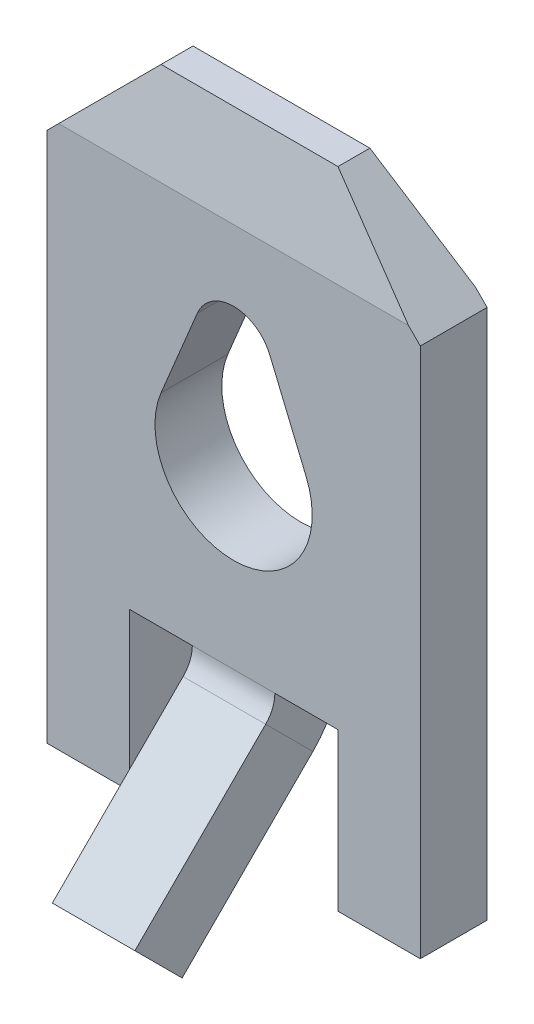
ISO-10303-21;
HEADER;
FILE_DESCRIPTION(('STEP AP214'),'2;1');
FILE_NAME('part.step','',(''),(''),'','','');
FILE_SCHEMA(('AUTOMOTIVE_DESIGN { 1 0 10303 214 1 1 1 1 }'));
ENDSEC;
DATA;
#1=APPLICATION_CONTEXT('core data for automotive mechanical design processes');
#2=APPLICATION_PROTOCOL_DEFINITION('international standard','automotive_design',2000,#1);
#3=PRODUCT_CONTEXT('',#1,'mechanical');
#4=PRODUCT('Part','Part','',(#3));
#5=PRODUCT_RELATED_PRODUCT_CATEGORY('part','',(#4));
#6=PRODUCT_DEFINITION_FORMATION('','',#4);
#7=PRODUCT_DEFINITION_CONTEXT('part definition',#1,'design');
#8=PRODUCT_DEFINITION('design','',#6,#7);
#9=PRODUCT_DEFINITION_SHAPE('','',#8);
#10=(LENGTH_UNIT() NAMED_UNIT(*) SI_UNIT(.MILLI.,.METRE.));
#11=(NAMED_UNIT(*) PLANE_ANGLE_UNIT() SI_UNIT($,.RADIAN.));
#12=(NAMED_UNIT(*) SI_UNIT($,.STERADIAN.) SOLID_ANGLE_UNIT());
#13=UNCERTAINTY_MEASURE_WITH_UNIT(LENGTH_MEASURE(1.E-05),#10,'distance_accuracy_value','');
#14=(GEOMETRIC_REPRESENTATION_CONTEXT(3) GLOBAL_UNCERTAINTY_ASSIGNED_CONTEXT((#13)) GLOBAL_UNIT_ASSIGNED_CONTEXT((#10,
#11,#12)) REPRESENTATION_CONTEXT('',''));
#15=CARTESIAN_POINT('',(0.,0.,0.));
#16=DIRECTION('',(0.,0.,1.));
#17=DIRECTION('',(1.,0.,0.));
#18=AXIS2_PLACEMENT_3D('',#15,#16,#17);
#19=CARTESIAN_POINT('',(4.75,0.149999999999999,0.));
#20=DIRECTION('',(0.,0.,1.));
#21=DIRECTION('',(0.,-1.,0.));
#22=AXIS2_PLACEMENT_3D('',#19,#20,#21);
#23=PLANE('',#22);
#24=DIRECTION('',(0.384813689288076,-0.922994271128754,0.));
#25=VECTOR('',#24,1.);
#26=CARTESIAN_POINT('',(2.84243697464802,5.82748992853653,0.));
#27=LINE('',#26,#25);
#28=CARTESIAN_POINT('',(2.84243697464802,5.82748992853653,0.));
#29=VERTEX_POINT('',#28);
#30=CARTESIAN_POINT('',(3.29799427112875,4.73481368928808,0.));
#31=VERTEX_POINT('',#30);
#32=EDGE_CURVE('E273',#29,#31,#27,.T.);
#33=ORIENTED_EDGE('',*,*,#32,.F.);
#34=CARTESIAN_POINT('',(2.375,5.65,0.));
#35=DIRECTION('',(0.,0.,1.));
#36=DIRECTION('',(0.,-1.,0.));
#37=AXIS2_PLACEMENT_3D('',#34,#35,#36);
#38=CIRCLE('',#37,0.5);
#39=CARTESIAN_POINT('',(1.91346153846154,5.84230769230769,0.));
#40=VERTEX_POINT('',#39);
#41=EDGE_CURVE('E276',#40,#29,#38,.F.);
#42=ORIENTED_EDGE('',*,*,#41,.F.);
#43=DIRECTION('',(0.384615384615385,0.923076923076923,0.));
#44=VECTOR('',#43,1.);
#45=CARTESIAN_POINT('',(1.91346153846154,5.84230769230769,0.));
#46=LINE('',#45,#44);
#47=CARTESIAN_POINT('',(1.45192307692308,4.73461538461538,0.));
#48=VERTEX_POINT('',#47);
#49=EDGE_CURVE('E278',#48,#40,#46,.T.);
#50=ORIENTED_EDGE('',*,*,#49,.F.);
#51=CARTESIAN_POINT('',(2.375,4.35,0.));
#52=DIRECTION('',(0.,0.,1.));
#53=DIRECTION('',(0.,-1.,0.));
#54=AXIS2_PLACEMENT_3D('',#51,#52,#53);
#55=CIRCLE('',#54,1.);
#56=EDGE_CURVE('E270',#31,#48,#55,.F.);
#57=ORIENTED_EDGE('',*,*,#56,.F.);
#58=EDGE_LOOP('',(#33,#42,#50,#57));
#59=FACE_BOUND('',#58,.T.);
#60=DIRECTION('',(1.,0.,0.));
#61=VECTOR('',#60,1.);
#62=CARTESIAN_POINT('',(2.9,2.15,0.));
#63=LINE('',#62,#61);
#64=CARTESIAN_POINT('',(2.9,2.15,0.));
#65=VERTEX_POINT('',#64);
#66=CARTESIAN_POINT('',(3.7,2.15,0.));
#67=VERTEX_POINT('',#66);
#68=EDGE_CURVE('E238',#65,#67,#63,.T.);
#69=ORIENTED_EDGE('',*,*,#68,.F.);
#70=DIRECTION('',(-1.,0.,0.));
#71=VECTOR('',#70,1.);
#72=CARTESIAN_POINT('',(4.75,2.15,0.));
#73=LINE('',#72,#71);
#74=CARTESIAN_POINT('',(1.85000000000001,2.15,0.));
#75=VERTEX_POINT('',#74);
#76=EDGE_CURVE('E51',#65,#75,#73,.T.);
#77=ORIENTED_EDGE('',*,*,#76,.T.);
#78=DIRECTION('',(1.,0.,0.));
#79=VECTOR('',#78,1.);
#80=CARTESIAN_POINT('',(1.85,2.15,0.));
#81=LINE('',#80,#79);
#82=CARTESIAN_POINT('',(1.05,2.15,0.));
#83=VERTEX_POINT('',#82);
#84=EDGE_CURVE('E249',#83,#75,#81,.T.);
#85=ORIENTED_EDGE('',*,*,#84,.F.);
#86=DIRECTION('',(0.,1.,0.));
#87=VECTOR('',#86,1.);
#88=CARTESIAN_POINT('',(1.05,2.15,0.));
#89=LINE('',#88,#87);
#90=CARTESIAN_POINT('',(1.05,0.149999999999999,0.));
#91=VERTEX_POINT('',#90);
#92=EDGE_CURVE('E247',#91,#83,#89,.T.);
#93=ORIENTED_EDGE('',*,*,#92,.F.);
#94=DIRECTION('',(-1.,0.,0.));
#95=VECTOR('',#94,1.);
#96=CARTESIAN_POINT('',(4.75,0.149999999999999,0.));
#97=LINE('',#96,#95);
#98=CARTESIAN_POINT('',(0.,0.149999999999999,0.));
#99=VERTEX_POINT('',#98);
#100=EDGE_CURVE('E347',#91,#99,#97,.T.);
#101=ORIENTED_EDGE('',*,*,#100,.T.);
#102=DIRECTION('',(0.,1.,0.));
#103=VECTOR('',#102,1.);
#104=CARTESIAN_POINT('',(0.,0.149999999999999,0.));
#105=LINE('',#104,#103);
#106=CARTESIAN_POINT('',(0.,6.9,0.));
#107=VERTEX_POINT('',#106);
#108=EDGE_CURVE('E332',#99,#107,#105,.T.);
#109=ORIENTED_EDGE('',*,*,#108,.T.);
#110=DIRECTION('',(-0.707106781186548,-0.707106781186548,0.));
#111=VECTOR('',#110,1.);
#112=CARTESIAN_POINT('',(0.,6.9,0.));
#113=LINE('',#112,#111);
#114=CARTESIAN_POINT('',(0.15,7.05,0.));
#115=VERTEX_POINT('',#114);
#116=EDGE_CURVE('E306',#115,#107,#113,.T.);
#117=ORIENTED_EDGE('',*,*,#116,.F.);
#118=DIRECTION('',(-1.,0.,0.));
#119=VECTOR('',#118,1.);
#120=CARTESIAN_POINT('',(4.75,7.05,0.));
#121=LINE('',#120,#119);
#122=CARTESIAN_POINT('',(4.6,7.05,0.));
#123=VERTEX_POINT('',#122);
#124=EDGE_CURVE('E337',#123,#115,#121,.T.);
#125=ORIENTED_EDGE('',*,*,#124,.F.);
#126=DIRECTION('',(-0.707106781186548,0.707106781186548,0.));
#127=VECTOR('',#126,1.);
#128=CARTESIAN_POINT('',(3.5,8.15,0.));
#129=LINE('',#128,#127);
#130=CARTESIAN_POINT('',(4.75,6.9,0.));
#131=VERTEX_POINT('',#130);
#132=EDGE_CURVE('E302',#131,#123,#129,.T.);
#133=ORIENTED_EDGE('',*,*,#132,.F.);
#134=DIRECTION('',(0.,1.,0.));
#135=VECTOR('',#134,1.);
#136=CARTESIAN_POINT('',(4.75,0.149999999999999,0.));
#137=LINE('',#136,#135);
#138=CARTESIAN_POINT('',(4.75,0.149999999999999,0.));
#139=VERTEX_POINT('',#138);
#140=EDGE_CURVE('E334',#139,#131,#137,.T.);
#141=ORIENTED_EDGE('',*,*,#140,.F.);
#142=CARTESIAN_POINT('',(3.7,0.149999999999999,0.));
#143=VERTEX_POINT('',#142);
#144=EDGE_CURVE('E348',#139,#143,#97,.T.);
#145=ORIENTED_EDGE('',*,*,#144,.T.);
#146=DIRECTION('',(0.,-1.,0.));
#147=VECTOR('',#146,1.);
#148=CARTESIAN_POINT('',(3.7,2.15,0.));
#149=LINE('',#148,#147);
#150=EDGE_CURVE('E262',#67,#143,#149,.T.);
#151=ORIENTED_EDGE('',*,*,#150,.F.);
#152=EDGE_LOOP('',(#69,#77,#85,#93,#101,#109,#117,#125,#133,#141,#145,#151));
#153=FACE_BOUND('',#152,.T.);
#154=ADVANCED_FACE('F44',(#59,#153),#23,.F.);
#155=CARTESIAN_POINT('',(4.75,7.05,0.85));
#156=DIRECTION('',(0.,0.,-1.));
#157=DIRECTION('',(0.,1.,0.));
#158=AXIS2_PLACEMENT_3D('',#155,#156,#157);
#159=PLANE('',#158);
#160=DIRECTION('',(-0.384615384615385,-0.923076923076923,0.));
#161=VECTOR('',#160,1.);
#162=CARTESIAN_POINT('',(1.91346153846154,5.84230769230769,0.849999999999999));
#163=LINE('',#162,#161);
#164=CARTESIAN_POINT('',(1.91346153846154,5.84230769230769,0.85));
#165=VERTEX_POINT('',#164);
#166=CARTESIAN_POINT('',(1.45192307692308,4.73461538461538,0.849999999999999));
#167=VERTEX_POINT('',#166);
#168=EDGE_CURVE('E280',#165,#167,#163,.T.);
#169=ORIENTED_EDGE('',*,*,#168,.F.);
#170=CARTESIAN_POINT('',(2.375,5.65,0.849999999999999));
#171=DIRECTION('',(0.,0.,1.));
#172=DIRECTION('',(1.,0.,0.));
#173=AXIS2_PLACEMENT_3D('',#170,#171,#172);
#174=CIRCLE('',#173,0.5);
#175=CARTESIAN_POINT('',(2.84243697464802,5.82748992853653,0.849999999999999));
#176=VERTEX_POINT('',#175);
#177=EDGE_CURVE('E256',#176,#165,#174,.T.);
#178=ORIENTED_EDGE('',*,*,#177,.F.);
#179=DIRECTION('',(-0.384813689288076,0.922994271128754,0.));
#180=VECTOR('',#179,1.);
#181=CARTESIAN_POINT('',(2.84243697464802,5.82748992853653,0.849999999999999));
#182=LINE('',#181,#180);
#183=CARTESIAN_POINT('',(3.29799427112875,4.73481368928808,0.849999999999999));
#184=VERTEX_POINT('',#183);
#185=EDGE_CURVE('E286',#184,#176,#182,.T.);
#186=ORIENTED_EDGE('',*,*,#185,.F.);
#187=CARTESIAN_POINT('',(2.375,4.35,0.849999999999999));
#188=DIRECTION('',(0.,0.,1.));
#189=DIRECTION('',(1.,0.,0.));
#190=AXIS2_PLACEMENT_3D('',#187,#188,#189);
#191=CIRCLE('',#190,1.);
#192=EDGE_CURVE('E283',#167,#184,#191,.T.);
#193=ORIENTED_EDGE('',*,*,#192,.F.);
#194=EDGE_LOOP('',(#169,#178,#186,#193));
#195=FACE_BOUND('',#194,.T.);
#196=DIRECTION('',(-1.,0.,0.));
#197=VECTOR('',#196,1.);
#198=CARTESIAN_POINT('',(1.85,2.15,0.85));
#199=LINE('',#198,#197);
#200=CARTESIAN_POINT('',(1.85000000000001,2.15,0.849999999999999));
#201=VERTEX_POINT('',#200);
#202=CARTESIAN_POINT('',(1.05,2.15,0.85));
#203=VERTEX_POINT('',#202);
#204=EDGE_CURVE('E243',#201,#203,#199,.T.);
#205=ORIENTED_EDGE('',*,*,#204,.F.);
#206=DIRECTION('',(1.,0.,0.));
#207=VECTOR('',#206,1.);
#208=CARTESIAN_POINT('',(4.75,2.15,0.849999999999999));
#209=LINE('',#208,#207);
#210=CARTESIAN_POINT('',(2.9,2.15,0.849999999999999));
#211=VERTEX_POINT('',#210);
#212=EDGE_CURVE('E364',#201,#211,#209,.T.);
#213=ORIENTED_EDGE('',*,*,#212,.T.);
#214=DIRECTION('',(-1.,0.,0.));
#215=VECTOR('',#214,1.);
#216=CARTESIAN_POINT('',(2.9,2.15,0.85));
#217=LINE('',#216,#215);
#218=CARTESIAN_POINT('',(3.7,2.15,0.85));
#219=VERTEX_POINT('',#218);
#220=EDGE_CURVE('E250',#219,#211,#217,.T.);
#221=ORIENTED_EDGE('',*,*,#220,.F.);
#222=DIRECTION('',(0.,1.,0.));
#223=VECTOR('',#222,1.);
#224=CARTESIAN_POINT('',(3.7,2.15,0.85));
#225=LINE('',#224,#223);
#226=CARTESIAN_POINT('',(3.7,0.149999999999999,0.849999999999999));
#227=VERTEX_POINT('',#226);
#228=EDGE_CURVE('E257',#227,#219,#225,.T.);
#229=ORIENTED_EDGE('',*,*,#228,.F.);
#230=DIRECTION('',(-1.,0.,0.));
#231=VECTOR('',#230,1.);
#232=CARTESIAN_POINT('',(4.75,0.149999999999999,0.849999999999999));
#233=LINE('',#232,#231);
#234=CARTESIAN_POINT('',(4.75,0.149999999999999,0.849999999999999));
#235=VERTEX_POINT('',#234);
#236=EDGE_CURVE('E352',#235,#227,#233,.T.);
#237=ORIENTED_EDGE('',*,*,#236,.F.);
#238=DIRECTION('',(0.,-1.,0.));
#239=VECTOR('',#238,1.);
#240=CARTESIAN_POINT('',(4.75,7.05,0.85));
#241=LINE('',#240,#239);
#242=CARTESIAN_POINT('',(4.75,6.9,0.85));
#243=VERTEX_POINT('',#242);
#244=EDGE_CURVE('E329',#243,#235,#241,.T.);
#245=ORIENTED_EDGE('',*,*,#244,.F.);
#246=DIRECTION('',(0.707106781186548,-0.707106781186548,0.));
#247=VECTOR('',#246,1.);
#248=CARTESIAN_POINT('',(3.5,8.15,0.849999999999999));
#249=LINE('',#248,#247);
#250=CARTESIAN_POINT('',(4.6,7.05,0.849999999999999));
#251=VERTEX_POINT('',#250);
#252=EDGE_CURVE('E298',#251,#243,#249,.T.);
#253=ORIENTED_EDGE('',*,*,#252,.F.);
#254=DIRECTION('',(-1.,0.,0.));
#255=VECTOR('',#254,1.);
#256=CARTESIAN_POINT('',(4.75,7.05,0.85));
#257=LINE('',#256,#255);
#258=CARTESIAN_POINT('',(0.15,7.05,0.849999999999999));
#259=VERTEX_POINT('',#258);
#260=EDGE_CURVE('E355',#251,#259,#257,.T.);
#261=ORIENTED_EDGE('',*,*,#260,.T.);
#262=DIRECTION('',(0.707106781186547,0.707106781186548,0.));
#263=VECTOR('',#262,1.);
#264=CARTESIAN_POINT('',(0.,6.9,0.849999999999999));
#265=LINE('',#264,#263);
#266=CARTESIAN_POINT('',(0.,6.9,0.849999999999999));
#267=VERTEX_POINT('',#266);
#268=EDGE_CURVE('E299',#267,#259,#265,.T.);
#269=ORIENTED_EDGE('',*,*,#268,.F.);
#270=DIRECTION('',(0.,-1.,0.));
#271=VECTOR('',#270,1.);
#272=CARTESIAN_POINT('',(0.,7.05,0.85));
#273=LINE('',#272,#271);
#274=CARTESIAN_POINT('',(0.,0.149999999999999,0.849999999999999));
#275=VERTEX_POINT('',#274);
#276=EDGE_CURVE('E328',#267,#275,#273,.T.);
#277=ORIENTED_EDGE('',*,*,#276,.T.);
#278=CARTESIAN_POINT('',(1.05,0.149999999999999,0.849999999999999));
#279=VERTEX_POINT('',#278);
#280=EDGE_CURVE('E351',#279,#275,#233,.T.);
#281=ORIENTED_EDGE('',*,*,#280,.F.);
#282=DIRECTION('',(0.,-1.,0.));
#283=VECTOR('',#282,1.);
#284=CARTESIAN_POINT('',(1.05,2.15,0.85));
#285=LINE('',#284,#283);
#286=EDGE_CURVE('E245',#203,#279,#285,.T.);
#287=ORIENTED_EDGE('',*,*,#286,.F.);
#288=EDGE_LOOP('',(#205,#213,#221,#229,#237,#245,#253,#261,#269,#277,#281,#287));
#289=FACE_BOUND('',#288,.T.);
#290=ADVANCED_FACE('F384',(#195,#289),#159,.F.);
#291=CARTESIAN_POINT('',(4.75,0.149999999999999,0.));
#292=DIRECTION('',(0.,1.,0.));
#293=DIRECTION('',(0.,0.,1.));
#294=AXIS2_PLACEMENT_3D('',#291,#292,#293);
#295=PLANE('',#294);
#296=ORIENTED_EDGE('',*,*,#100,.F.);
#297=DIRECTION('',(0.,0.,-1.));
#298=VECTOR('',#297,1.);
#299=CARTESIAN_POINT('',(1.05,0.149999999999999,3.0040659228538));
#300=LINE('',#299,#298);
#301=EDGE_CURVE('E65',#279,#91,#300,.T.);
#302=ORIENTED_EDGE('',*,*,#301,.F.);
#303=ORIENTED_EDGE('',*,*,#280,.T.);
#304=DIRECTION('',(0.,0.,-1.));
#305=VECTOR('',#304,1.);
#306=CARTESIAN_POINT('',(0.,0.149999999999999,0.));
#307=LINE('',#306,#305);
#308=EDGE_CURVE('E340',#275,#99,#307,.T.);
#309=ORIENTED_EDGE('',*,*,#308,.T.);
#310=EDGE_LOOP('',(#296,#302,#303,#309));
#311=FACE_BOUND('',#310,.T.);
#312=ADVANCED_FACE('F419',(#311),#295,.F.);
#313=CARTESIAN_POINT('',(4.75,7.05,0.));
#314=DIRECTION('',(0.,-0.214348018272916,0.976757353216485));
#315=DIRECTION('',(0.,-0.976757353216485,-0.214348018272916));
#316=AXIS2_PLACEMENT_3D('',#313,#314,#315);
#317=PLANE('',#316);
#318=ORIENTED_EDGE('',*,*,#124,.T.);
#319=DIRECTION('',(0.698744344369524,0.698744344369524,0.153338457091523));
#320=VECTOR('',#319,1.);
#321=CARTESIAN_POINT('',(2.39592083042662,9.29592083042662,0.492864146468432));
#322=LINE('',#321,#320);
#323=CARTESIAN_POINT('',(1.25,8.15,0.241393442622949));
#324=VERTEX_POINT('',#323);
#325=EDGE_CURVE('E319',#115,#324,#322,.T.);
#326=ORIENTED_EDGE('',*,*,#325,.T.);
#327=DIRECTION('',(-1.,0.,0.));
#328=VECTOR('',#327,1.);
#329=CARTESIAN_POINT('',(4.75,8.15,0.241393442622949));
#330=LINE('',#329,#328);
#331=CARTESIAN_POINT('',(3.5,8.15,0.241393442622949));
#332=VERTEX_POINT('',#331);
#333=EDGE_CURVE('E361',#332,#324,#330,.T.);
#334=ORIENTED_EDGE('',*,*,#333,.F.);
#335=DIRECTION('',(0.698744344369524,-0.698744344369524,-0.153338457091523));
#336=VECTOR('',#335,1.);
#337=CARTESIAN_POINT('',(4.67323654881826,6.97676345118174,-0.0160716569500576));
#338=LINE('',#337,#336);
#339=EDGE_CURVE('E325',#332,#123,#338,.T.);
#340=ORIENTED_EDGE('',*,*,#339,.T.);
#341=EDGE_LOOP('',(#318,#326,#334,#340));
#342=FACE_BOUND('',#341,.T.);
#343=ADVANCED_FACE('F481',(#342),#317,.F.);
#344=CARTESIAN_POINT('',(4.75,8.15,0.241393442622949));
#345=DIRECTION('',(0.,-1.,0.));
#346=DIRECTION('',(0.,0.,-1.));
#347=AXIS2_PLACEMENT_3D('',#344,#345,#346);
#348=PLANE('',#347);
#349=ORIENTED_EDGE('',*,*,#333,.T.);
#350=DIRECTION('',(0.,0.,1.));
#351=VECTOR('',#350,1.);
#352=CARTESIAN_POINT('',(1.25,8.15,-1.76776695296637));
#353=LINE('',#352,#351);
#354=CARTESIAN_POINT('',(1.25,8.15,0.647131147540979));
#355=VERTEX_POINT('',#354);
#356=EDGE_CURVE('E303',#324,#355,#353,.T.);
#357=ORIENTED_EDGE('',*,*,#356,.T.);
#358=DIRECTION('',(-1.,0.,0.));
#359=VECTOR('',#358,1.);
#360=CARTESIAN_POINT('',(4.75,8.15,0.647131147540979));
#361=LINE('',#360,#359);
#362=CARTESIAN_POINT('',(3.5,8.15,0.647131147540979));
#363=VERTEX_POINT('',#362);
#364=EDGE_CURVE('E358',#363,#355,#361,.T.);
#365=ORIENTED_EDGE('',*,*,#364,.F.);
#366=DIRECTION('',(0.,0.,1.));
#367=VECTOR('',#366,1.);
#368=CARTESIAN_POINT('',(3.5,8.15,-1.76776695296637));
#369=LINE('',#368,#367);
#370=EDGE_CURVE('E311',#332,#363,#369,.T.);
#371=ORIENTED_EDGE('',*,*,#370,.F.);
#372=EDGE_LOOP('',(#349,#357,#365,#371));
#373=FACE_BOUND('',#372,.T.);
#374=ADVANCED_FACE('F477',(#373),#348,.F.);
#375=CARTESIAN_POINT('',(4.75,8.15,0.647131147540979));
#376=DIRECTION('',(0.,-0.181367589437408,-0.983415373838371));
#377=DIRECTION('',(0.,0.983415373838371,-0.181367589437408));
#378=AXIS2_PLACEMENT_3D('',#375,#376,#377);
#379=PLANE('',#378);
#380=ORIENTED_EDGE('',*,*,#364,.T.);
#381=DIRECTION('',(-0.70116968993079,-0.70116968993079,0.12931408215937));
#382=VECTOR('',#381,1.);
#383=CARTESIAN_POINT('',(2.97073626927174,9.87073626927174,0.329782245421185));
#384=LINE('',#383,#382);
#385=EDGE_CURVE('E309',#355,#259,#384,.T.);
#386=ORIENTED_EDGE('',*,*,#385,.T.);
#387=ORIENTED_EDGE('',*,*,#260,.F.);
#388=DIRECTION('',(-0.70116968993079,0.70116968993079,-0.12931408215937));
#389=VECTOR('',#388,1.);
#390=CARTESIAN_POINT('',(4.11454866759705,7.53545133240295,0.760470041155192));
#391=LINE('',#390,#389);
#392=EDGE_CURVE('E322',#251,#363,#391,.T.);
#393=ORIENTED_EDGE('',*,*,#392,.T.);
#394=EDGE_LOOP('',(#380,#386,#387,#393));
#395=FACE_BOUND('',#394,.T.);
#396=ADVANCED_FACE('F473',(#395),#379,.F.);
#397=ORIENTED_EDGE('',*,*,#236,.T.);
#398=DIRECTION('',(0.,0.,-1.));
#399=VECTOR('',#398,1.);
#400=CARTESIAN_POINT('',(3.7,0.149999999999999,3.0040659228538));
#401=LINE('',#400,#399);
#402=EDGE_CURVE('E259',#227,#143,#401,.T.);
#403=ORIENTED_EDGE('',*,*,#402,.T.);
#404=ORIENTED_EDGE('',*,*,#144,.F.);
#405=DIRECTION('',(0.,0.,-1.));
#406=VECTOR('',#405,1.);
#407=CARTESIAN_POINT('',(4.75,0.149999999999999,0.));
#408=LINE('',#407,#406);
#409=EDGE_CURVE('E331',#235,#139,#408,.T.);
#410=ORIENTED_EDGE('',*,*,#409,.F.);
#411=EDGE_LOOP('',(#397,#403,#404,#410));
#412=FACE_BOUND('',#411,.T.);
#413=ADVANCED_FACE('F466',(#412),#295,.F.);
#414=CARTESIAN_POINT('',(4.75,0.,0.));
#415=DIRECTION('',(1.,0.,0.));
#416=DIRECTION('',(0.,0.,-1.));
#417=AXIS2_PLACEMENT_3D('',#414,#415,#416);
#418=PLANE('',#417);
#419=DIRECTION('',(0.,0.,1.));
#420=VECTOR('',#419,1.);
#421=CARTESIAN_POINT('',(4.75,6.9,-1.76776695296637));
#422=LINE('',#421,#420);
#423=EDGE_CURVE('E312',#131,#243,#422,.T.);
#424=ORIENTED_EDGE('',*,*,#423,.T.);
#425=ORIENTED_EDGE('',*,*,#244,.T.);
#426=ORIENTED_EDGE('',*,*,#409,.T.);
#427=ORIENTED_EDGE('',*,*,#140,.T.);
#428=EDGE_LOOP('',(#424,#425,#426,#427));
#429=FACE_BOUND('',#428,.T.);
#430=ADVANCED_FACE('F463',(#429),#418,.T.);
#431=CARTESIAN_POINT('',(0.,0.,0.));
#432=DIRECTION('',(1.,0.,0.));
#433=DIRECTION('',(0.,0.,-1.));
#434=AXIS2_PLACEMENT_3D('',#431,#432,#433);
#435=PLANE('',#434);
#436=ORIENTED_EDGE('',*,*,#276,.F.);
#437=DIRECTION('',(0.,0.,1.));
#438=VECTOR('',#437,1.);
#439=CARTESIAN_POINT('',(0.,6.9,-1.76776695296637));
#440=LINE('',#439,#438);
#441=EDGE_CURVE('E301',#107,#267,#440,.T.);
#442=ORIENTED_EDGE('',*,*,#441,.F.);
#443=ORIENTED_EDGE('',*,*,#108,.F.);
#444=ORIENTED_EDGE('',*,*,#308,.F.);
#445=EDGE_LOOP('',(#436,#442,#443,#444));
#446=FACE_BOUND('',#445,.T.);
#447=ADVANCED_FACE('F458',(#446),#435,.F.);
#448=CARTESIAN_POINT('',(0.,6.9,-1.76776695296637));
#449=DIRECTION('',(0.707106781186548,-0.707106781186548,0.));
#450=DIRECTION('',(0.707106781186548,0.707106781186548,0.));
#451=AXIS2_PLACEMENT_3D('',#448,#449,#450);
#452=PLANE('',#451);
#453=ORIENTED_EDGE('',*,*,#116,.T.);
#454=ORIENTED_EDGE('',*,*,#441,.T.);
#455=ORIENTED_EDGE('',*,*,#268,.T.);
#456=ORIENTED_EDGE('',*,*,#385,.F.);
#457=ORIENTED_EDGE('',*,*,#356,.F.);
#458=ORIENTED_EDGE('',*,*,#325,.F.);
#459=EDGE_LOOP('',(#453,#454,#455,#456,#457,#458));
#460=FACE_BOUND('',#459,.T.);
#461=ADVANCED_FACE('F455',(#460),#452,.F.);
#462=CARTESIAN_POINT('',(3.5,8.15,-1.76776695296637));
#463=DIRECTION('',(-0.707106781186547,-0.707106781186547,0.));
#464=DIRECTION('',(0.707106781186548,-0.707106781186548,0.));
#465=AXIS2_PLACEMENT_3D('',#462,#463,#464);
#466=PLANE('',#465);
#467=ORIENTED_EDGE('',*,*,#370,.T.);
#468=ORIENTED_EDGE('',*,*,#392,.F.);
#469=ORIENTED_EDGE('',*,*,#252,.T.);
#470=ORIENTED_EDGE('',*,*,#423,.F.);
#471=ORIENTED_EDGE('',*,*,#132,.T.);
#472=ORIENTED_EDGE('',*,*,#339,.F.);
#473=EDGE_LOOP('',(#467,#468,#469,#470,#471,#472));
#474=FACE_BOUND('',#473,.T.);
#475=ADVANCED_FACE('F454',(#474),#466,.F.);
#476=CARTESIAN_POINT('',(2.375,5.65,-3.44093010681705));
#477=DIRECTION('',(0.,0.,1.));
#478=DIRECTION('',(1.,0.,0.));
#479=AXIS2_PLACEMENT_3D('',#476,#477,#478);
#480=CYLINDRICAL_SURFACE('',#479,0.5);
#481=ORIENTED_EDGE('',*,*,#41,.T.);
#482=DIRECTION('',(0.,0.,1.));
#483=VECTOR('',#482,1.);
#484=CARTESIAN_POINT('',(2.84243697464802,5.82748992853653,-3.44093010681705));
#485=LINE('',#484,#483);
#486=EDGE_CURVE('E274',#29,#176,#485,.T.);
#487=ORIENTED_EDGE('',*,*,#486,.T.);
#488=ORIENTED_EDGE('',*,*,#177,.T.);
#489=DIRECTION('',(0.,0.,1.));
#490=VECTOR('',#489,1.);
#491=CARTESIAN_POINT('',(1.91346153846154,5.84230769230769,-3.44093010681705));
#492=LINE('',#491,#490);
#493=EDGE_CURVE('E289',#40,#165,#492,.T.);
#494=ORIENTED_EDGE('',*,*,#493,.F.);
#495=EDGE_LOOP('',(#481,#487,#488,#494));
#496=FACE_BOUND('',#495,.T.);
#497=ADVANCED_FACE('F437',(#496),#480,.F.);
#498=CARTESIAN_POINT('',(2.84243697464802,5.82748992853653,-3.44093010681705));
#499=DIRECTION('',(0.922994271128754,0.384813689288076,0.));
#500=DIRECTION('',(-0.384813689288076,0.922994271128754,0.));
#501=AXIS2_PLACEMENT_3D('',#498,#499,#500);
#502=PLANE('',#501);
#503=ORIENTED_EDGE('',*,*,#32,.T.);
#504=DIRECTION('',(0.,0.,1.));
#505=VECTOR('',#504,1.);
#506=CARTESIAN_POINT('',(3.29799427112875,4.73481368928808,-3.44093010681705));
#507=LINE('',#506,#505);
#508=EDGE_CURVE('E291',#31,#184,#507,.T.);
#509=ORIENTED_EDGE('',*,*,#508,.T.);
#510=ORIENTED_EDGE('',*,*,#185,.T.);
#511=ORIENTED_EDGE('',*,*,#486,.F.);
#512=EDGE_LOOP('',(#503,#509,#510,#511));
#513=FACE_BOUND('',#512,.T.);
#514=ADVANCED_FACE('F428',(#513),#502,.F.);
#515=CARTESIAN_POINT('',(2.375,4.35,-3.44093010681705));
#516=DIRECTION('',(0.,0.,1.));
#517=DIRECTION('',(1.,0.,0.));
#518=AXIS2_PLACEMENT_3D('',#515,#516,#517);
#519=CYLINDRICAL_SURFACE('',#518,1.);
#520=ORIENTED_EDGE('',*,*,#56,.T.);
#521=DIRECTION('',(0.,0.,1.));
#522=VECTOR('',#521,1.);
#523=CARTESIAN_POINT('',(1.45192307692308,4.73461538461538,-3.44093010681705));
#524=LINE('',#523,#522);
#525=EDGE_CURVE('E293',#48,#167,#524,.T.);
#526=ORIENTED_EDGE('',*,*,#525,.T.);
#527=ORIENTED_EDGE('',*,*,#192,.T.);
#528=ORIENTED_EDGE('',*,*,#508,.F.);
#529=EDGE_LOOP('',(#520,#526,#527,#528));
#530=FACE_BOUND('',#529,.T.);
#531=ADVANCED_FACE('F430',(#530),#519,.F.);
#532=CARTESIAN_POINT('',(1.91346153846154,5.84230769230769,-3.44093010681705));
#533=DIRECTION('',(-0.923076923076923,0.384615384615385,0.));
#534=DIRECTION('',(-0.384615384615385,-0.923076923076923,0.));
#535=AXIS2_PLACEMENT_3D('',#532,#533,#534);
#536=PLANE('',#535);
#537=ORIENTED_EDGE('',*,*,#49,.T.);
#538=ORIENTED_EDGE('',*,*,#493,.T.);
#539=ORIENTED_EDGE('',*,*,#168,.T.);
#540=ORIENTED_EDGE('',*,*,#525,.F.);
#541=EDGE_LOOP('',(#537,#538,#539,#540));
#542=FACE_BOUND('',#541,.T.);
#543=ADVANCED_FACE('F439',(#542),#536,.F.);
#544=CARTESIAN_POINT('',(3.7,2.15,3.0040659228538));
#545=DIRECTION('',(1.,0.,0.));
#546=DIRECTION('',(0.,1.,0.));
#547=AXIS2_PLACEMENT_3D('',#544,#545,#546);
#548=PLANE('',#547);
#549=ORIENTED_EDGE('',*,*,#228,.T.);
#550=DIRECTION('',(0.,0.,-1.));
#551=VECTOR('',#550,1.);
#552=CARTESIAN_POINT('',(3.7,2.15,3.0040659228538));
#553=LINE('',#552,#551);
#554=EDGE_CURVE('E264',#219,#67,#553,.T.);
#555=ORIENTED_EDGE('',*,*,#554,.T.);
#556=ORIENTED_EDGE('',*,*,#150,.T.);
#557=ORIENTED_EDGE('',*,*,#402,.F.);
#558=EDGE_LOOP('',(#549,#555,#556,#557));
#559=FACE_BOUND('',#558,.T.);
#560=ADVANCED_FACE('F441',(#559),#548,.F.);
#561=CARTESIAN_POINT('',(2.9,2.15,3.0040659228538));
#562=DIRECTION('',(0.,1.,0.));
#563=DIRECTION('',(-1.,0.,0.));
#564=AXIS2_PLACEMENT_3D('',#561,#562,#563);
#565=PLANE('',#564);
#566=ORIENTED_EDGE('',*,*,#220,.T.);
#567=DIRECTION('',(0.,0.,-1.));
#568=VECTOR('',#567,1.);
#569=CARTESIAN_POINT('',(2.9,2.15,3.0040659228538));
#570=LINE('',#569,#568);
#571=EDGE_CURVE('E12',#211,#65,#570,.T.);
#572=ORIENTED_EDGE('',*,*,#571,.T.);
#573=ORIENTED_EDGE('',*,*,#68,.T.);
#574=ORIENTED_EDGE('',*,*,#554,.F.);
#575=EDGE_LOOP('',(#566,#572,#573,#574));
#576=FACE_BOUND('',#575,.T.);
#577=ADVANCED_FACE('F374',(#576),#565,.F.);
#578=CARTESIAN_POINT('',(1.85,2.15,3.0040659228538));
#579=DIRECTION('',(0.,1.,0.));
#580=DIRECTION('',(0.,0.,1.));
#581=AXIS2_PLACEMENT_3D('',#578,#579,#580);
#582=PLANE('',#581);
#583=ORIENTED_EDGE('',*,*,#204,.T.);
#584=DIRECTION('',(0.,0.,-1.));
#585=VECTOR('',#584,1.);
#586=CARTESIAN_POINT('',(1.05,2.15,3.0040659228538));
#587=LINE('',#586,#585);
#588=EDGE_CURVE('E246',#203,#83,#587,.T.);
#589=ORIENTED_EDGE('',*,*,#588,.T.);
#590=ORIENTED_EDGE('',*,*,#84,.T.);
#591=DIRECTION('',(0.,0.,-1.));
#592=VECTOR('',#591,1.);
#593=CARTESIAN_POINT('',(1.85,2.15,3.0040659228538));
#594=LINE('',#593,#592);
#595=EDGE_CURVE('E367',#201,#75,#594,.T.);
#596=ORIENTED_EDGE('',*,*,#595,.F.);
#597=EDGE_LOOP('',(#583,#589,#590,#596));
#598=FACE_BOUND('',#597,.T.);
#599=ADVANCED_FACE('F391',(#598),#582,.F.);
#600=CARTESIAN_POINT('',(1.05,2.15,3.0040659228538));
#601=DIRECTION('',(-1.,0.,0.));
#602=DIRECTION('',(0.,-1.,0.));
#603=AXIS2_PLACEMENT_3D('',#600,#601,#602);
#604=PLANE('',#603);
#605=ORIENTED_EDGE('',*,*,#286,.T.);
#606=ORIENTED_EDGE('',*,*,#301,.T.);
#607=ORIENTED_EDGE('',*,*,#92,.T.);
#608=ORIENTED_EDGE('',*,*,#588,.F.);
#609=EDGE_LOOP('',(#605,#606,#607,#608));
#610=FACE_BOUND('',#609,.T.);
#611=ADVANCED_FACE('F508',(#610),#604,.F.);
#612=CARTESIAN_POINT('',(1.85,2.15,1.25));
#613=DIRECTION('',(1.,0.,0.));
#614=DIRECTION('',(0.,1.,0.));
#615=AXIS2_PLACEMENT_3D('',#612,#613,#614);
#616=PLANE('',#615);
#617=ORIENTED_EDGE('',*,*,#595,.T.);
#618=CARTESIAN_POINT('',(1.85000000000001,2.15,1.25));
#619=DIRECTION('',(1.,0.,0.));
#620=DIRECTION('',(0.,1.,0.));
#621=AXIS2_PLACEMENT_3D('',#618,#619,#620);
#622=CIRCLE('',#621,1.25);
#623=CARTESIAN_POINT('',(1.85,1.26611652351682,0.366116523516817));
#624=VERTEX_POINT('',#623);
#625=EDGE_CURVE('E240',#75,#624,#622,.F.);
#626=ORIENTED_EDGE('',*,*,#625,.T.);
#627=DIRECTION('',(0.,0.707106781186544,0.707106781186551));
#628=VECTOR('',#627,1.);
#629=CARTESIAN_POINT('',(1.85,3.39031190869815,2.49031190869817));
#630=LINE('',#629,#628);
#631=CARTESIAN_POINT('',(1.85,1.86715728752538,0.967157287525381));
#632=VERTEX_POINT('',#631);
#633=EDGE_CURVE('E219',#624,#632,#630,.T.);
#634=ORIENTED_EDGE('',*,*,#633,.T.);
#635=CARTESIAN_POINT('',(1.85,2.15,1.25));
#636=DIRECTION('',(-1.,0.,0.));
#637=DIRECTION('',(0.,1.,0.));
#638=AXIS2_PLACEMENT_3D('',#635,#636,#637);
#639=CIRCLE('',#638,0.4);
#640=EDGE_CURVE('E231',#201,#632,#639,.T.);
#641=ORIENTED_EDGE('',*,*,#640,.F.);
#642=EDGE_LOOP('',(#617,#626,#634,#641));
#643=FACE_BOUND('',#642,.T.);
#644=ADVANCED_FACE('F393',(#643),#616,.F.);
#645=CARTESIAN_POINT('',(2.9,2.15,1.25));
#646=DIRECTION('',(-1.,0.,0.));
#647=DIRECTION('',(0.,0.,1.));
#648=AXIS2_PLACEMENT_3D('',#645,#646,#647);
#649=PLANE('',#648);
#650=DIRECTION('',(0.,-0.707106781186544,-0.707106781186551));
#651=VECTOR('',#650,1.);
#652=CARTESIAN_POINT('',(2.9,3.39031190869815,2.49031190869817));
#653=LINE('',#652,#651);
#654=CARTESIAN_POINT('',(2.9,1.86715728752538,0.96715728752538));
#655=VERTEX_POINT('',#654);
#656=CARTESIAN_POINT('',(2.9,1.26611652351682,0.366116523516817));
#657=VERTEX_POINT('',#656);
#658=EDGE_CURVE('E200',#655,#657,#653,.T.);
#659=ORIENTED_EDGE('',*,*,#658,.T.);
#660=CARTESIAN_POINT('',(2.9,2.15,1.25));
#661=DIRECTION('',(1.,0.,0.));
#662=DIRECTION('',(0.,1.,0.));
#663=AXIS2_PLACEMENT_3D('',#660,#661,#662);
#664=CIRCLE('',#663,1.25);
#665=EDGE_CURVE('E235',#657,#65,#664,.T.);
#666=ORIENTED_EDGE('',*,*,#665,.T.);
#667=ORIENTED_EDGE('',*,*,#571,.F.);
#668=CARTESIAN_POINT('',(2.9,2.15,1.25));
#669=DIRECTION('',(1.,0.,0.));
#670=DIRECTION('',(0.,0.,1.));
#671=AXIS2_PLACEMENT_3D('',#668,#669,#670);
#672=CIRCLE('',#671,0.4);
#673=EDGE_CURVE('E234',#655,#211,#672,.T.);
#674=ORIENTED_EDGE('',*,*,#673,.F.);
#675=EDGE_LOOP('',(#659,#666,#667,#674));
#676=FACE_BOUND('',#675,.T.);
#677=ADVANCED_FACE('F378',(#676),#649,.F.);
#678=CARTESIAN_POINT('',(0.876719746353102,2.15,1.25));
#679=DIRECTION('',(1.,0.,0.));
#680=DIRECTION('',(0.,1.,0.));
#681=AXIS2_PLACEMENT_3D('',#678,#679,#680);
#682=CYLINDRICAL_SURFACE('',#681,0.4);
#683=ORIENTED_EDGE('',*,*,#673,.T.);
#684=ORIENTED_EDGE('',*,*,#212,.F.);
#685=ORIENTED_EDGE('',*,*,#640,.T.);
#686=DIRECTION('',(1.,0.,0.));
#687=VECTOR('',#686,1.);
#688=CARTESIAN_POINT('',(4.75,1.86715728752538,0.967157287525383));
#689=LINE('',#688,#687);
#690=EDGE_CURVE('E229',#632,#655,#689,.T.);
#691=ORIENTED_EDGE('',*,*,#690,.T.);
#692=EDGE_LOOP('',(#683,#684,#685,#691));
#693=FACE_BOUND('',#692,.T.);
#694=ADVANCED_FACE('F381',(#693),#682,.F.);
#695=CARTESIAN_POINT('',(0.876719746353102,2.15,1.25));
#696=DIRECTION('',(1.,0.,0.));
#697=DIRECTION('',(0.,1.,0.));
#698=AXIS2_PLACEMENT_3D('',#695,#696,#697);
#699=CYLINDRICAL_SURFACE('',#698,1.25);
#700=ORIENTED_EDGE('',*,*,#665,.F.);
#701=DIRECTION('',(-1.,0.,0.));
#702=VECTOR('',#701,1.);
#703=CARTESIAN_POINT('',(4.75,1.26611652351682,0.366116523516814));
#704=LINE('',#703,#702);
#705=EDGE_CURVE('E222',#657,#624,#704,.T.);
#706=ORIENTED_EDGE('',*,*,#705,.T.);
#707=ORIENTED_EDGE('',*,*,#625,.F.);
#708=ORIENTED_EDGE('',*,*,#76,.F.);
#709=EDGE_LOOP('',(#700,#706,#707,#708));
#710=FACE_BOUND('',#709,.T.);
#711=ADVANCED_FACE('F394',(#710),#699,.T.);
#712=CARTESIAN_POINT('',(0.,-0.397031517045243,2.02926456407888));
#713=DIRECTION('',(0.,-0.707106781186546,0.707106781186549));
#714=DIRECTION('',(0.,-0.707106781186549,-0.707106781186546));
#715=AXIS2_PLACEMENT_3D('',#712,#713,#714);
#716=PLANE('',#715);
#717=DIRECTION('',(0.,0.707106781186549,0.707106781186546));
#718=VECTOR('',#717,1.);
#719=CARTESIAN_POINT('',(2.9,-0.397031517045244,2.02926456407888));
#720=LINE('',#719,#718);
#721=CARTESIAN_POINT('',(2.9,-0.397031517045244,2.02926456407888));
#722=VERTEX_POINT('',#721);
#723=CARTESIAN_POINT('',(2.9,0.204009246963322,2.63030532808745));
#724=VERTEX_POINT('',#723);
#725=EDGE_CURVE('E198',#722,#724,#720,.T.);
#726=ORIENTED_EDGE('',*,*,#725,.T.);
#727=DIRECTION('',(-1.,0.,0.));
#728=VECTOR('',#727,1.);
#729=CARTESIAN_POINT('',(2.9,0.204009246963322,2.63030532808745));
#730=LINE('',#729,#728);
#731=CARTESIAN_POINT('',(1.85,0.204009246963323,2.63030532808745));
#732=VERTEX_POINT('',#731);
#733=EDGE_CURVE('E207',#724,#732,#730,.T.);
#734=ORIENTED_EDGE('',*,*,#733,.T.);
#735=DIRECTION('',(0.,-0.707106781186549,-0.707106781186546));
#736=VECTOR('',#735,1.);
#737=CARTESIAN_POINT('',(1.85,0.204009246963323,2.63030532808745));
#738=LINE('',#737,#736);
#739=CARTESIAN_POINT('',(1.85,-0.397031517045243,2.02926456407888));
#740=VERTEX_POINT('',#739);
#741=EDGE_CURVE('E213',#732,#740,#738,.T.);
#742=ORIENTED_EDGE('',*,*,#741,.T.);
#743=DIRECTION('',(1.,0.,0.));
#744=VECTOR('',#743,1.);
#745=CARTESIAN_POINT('',(1.85,-0.397031517045243,2.02926456407888));
#746=LINE('',#745,#744);
#747=EDGE_CURVE('E218',#740,#722,#746,.T.);
#748=ORIENTED_EDGE('',*,*,#747,.T.);
#749=EDGE_LOOP('',(#726,#734,#742,#748));
#750=FACE_BOUND('',#749,.T.);
#751=ADVANCED_FACE('F216',(#750),#716,.T.);
#752=CARTESIAN_POINT('',(4.75,5.79015281833704,-2.95583824328629));
#753=DIRECTION('',(0.,-0.707106781186549,-0.707106781186546));
#754=DIRECTION('',(0.,0.707106781186546,-0.707106781186549));
#755=AXIS2_PLACEMENT_3D('',#752,#753,#754);
#756=PLANE('',#755);
#757=ORIENTED_EDGE('',*,*,#690,.F.);
#758=DIRECTION('',(0.,0.707106781186546,-0.707106781186549));
#759=VECTOR('',#758,1.);
#760=CARTESIAN_POINT('',(1.85,2.32532959052296,0.508984984527799));
#761=LINE('',#760,#759);
#762=EDGE_CURVE('E204',#732,#632,#761,.T.);
#763=ORIENTED_EDGE('',*,*,#762,.F.);
#764=ORIENTED_EDGE('',*,*,#733,.F.);
#765=DIRECTION('',(0.,-0.707106781186546,0.707106781186549));
#766=VECTOR('',#765,1.);
#767=CARTESIAN_POINT('',(2.9,2.32532959052296,0.508984984527799));
#768=LINE('',#767,#766);
#769=EDGE_CURVE('E194',#655,#724,#768,.T.);
#770=ORIENTED_EDGE('',*,*,#769,.F.);
#771=EDGE_LOOP('',(#757,#763,#764,#770));
#772=FACE_BOUND('',#771,.T.);
#773=ADVANCED_FACE('F208',(#772),#756,.F.);
#774=CARTESIAN_POINT('',(1.85,3.84848421169575,2.03213960570058));
#775=DIRECTION('',(1.,0.,0.));
#776=DIRECTION('',(0.,0.707106781186546,-0.707106781186549));
#777=AXIS2_PLACEMENT_3D('',#774,#775,#776);
#778=PLANE('',#777);
#779=ORIENTED_EDGE('',*,*,#633,.F.);
#780=DIRECTION('',(0.,-0.707106781186546,0.707106781186549));
#781=VECTOR('',#780,1.);
#782=CARTESIAN_POINT('',(1.85,1.7242888265144,-0.0920557794807644));
#783=LINE('',#782,#781);
#784=EDGE_CURVE('E398',#624,#740,#783,.T.);
#785=ORIENTED_EDGE('',*,*,#784,.T.);
#786=ORIENTED_EDGE('',*,*,#741,.F.);
#787=ORIENTED_EDGE('',*,*,#762,.T.);
#788=EDGE_LOOP('',(#779,#785,#786,#787));
#789=FACE_BOUND('',#788,.T.);
#790=ADVANCED_FACE('F402',(#789),#778,.F.);
#791=CARTESIAN_POINT('',(4.75,0.310075264141302,1.32215778289233));
#792=DIRECTION('',(0.,0.707106781186549,0.707106781186546));
#793=DIRECTION('',(0.,-0.707106781186546,0.707106781186549));
#794=AXIS2_PLACEMENT_3D('',#791,#792,#793);
#795=PLANE('',#794);
#796=ORIENTED_EDGE('',*,*,#705,.F.);
#797=DIRECTION('',(0.,0.707106781186546,-0.707106781186549));
#798=VECTOR('',#797,1.);
#799=CARTESIAN_POINT('',(2.9,1.7242888265144,-0.0920557794807646));
#800=LINE('',#799,#798);
#801=EDGE_CURVE('E203',#722,#657,#800,.T.);
#802=ORIENTED_EDGE('',*,*,#801,.F.);
#803=ORIENTED_EDGE('',*,*,#747,.F.);
#804=ORIENTED_EDGE('',*,*,#784,.F.);
#805=EDGE_LOOP('',(#796,#802,#803,#804));
#806=FACE_BOUND('',#805,.T.);
#807=ADVANCED_FACE('F397',(#806),#795,.F.);
#808=CARTESIAN_POINT('',(2.9,3.84848421169575,2.03213960570058));
#809=DIRECTION('',(-1.,0.,0.));
#810=DIRECTION('',(0.,-0.707106781186546,0.707106781186549));
#811=AXIS2_PLACEMENT_3D('',#808,#809,#810);
#812=PLANE('',#811);
#813=ORIENTED_EDGE('',*,*,#658,.F.);
#814=ORIENTED_EDGE('',*,*,#769,.T.);
#815=ORIENTED_EDGE('',*,*,#725,.F.);
#816=ORIENTED_EDGE('',*,*,#801,.T.);
#817=EDGE_LOOP('',(#813,#814,#815,#816));
#818=FACE_BOUND('',#817,.T.);
#819=ADVANCED_FACE('F196',(#818),#812,.F.);
#820=CLOSED_SHELL('',(#154,#290,#312,#343,#374,#396,#413,#430,#447,#461,#475,#497,#514,#531,
#543,#560,#577,#599,#611,#644,#677,#694,#711,#751,#773,#790,#807,#819));
#821=MANIFOLD_SOLID_BREP('B2',#820);
#822=ADVANCED_BREP_SHAPE_REPRESENTATION('',(#18,#821),#14);
#823=SHAPE_DEFINITION_REPRESENTATION(#9,#822);
ENDSEC;
END-ISO-10303-21;
